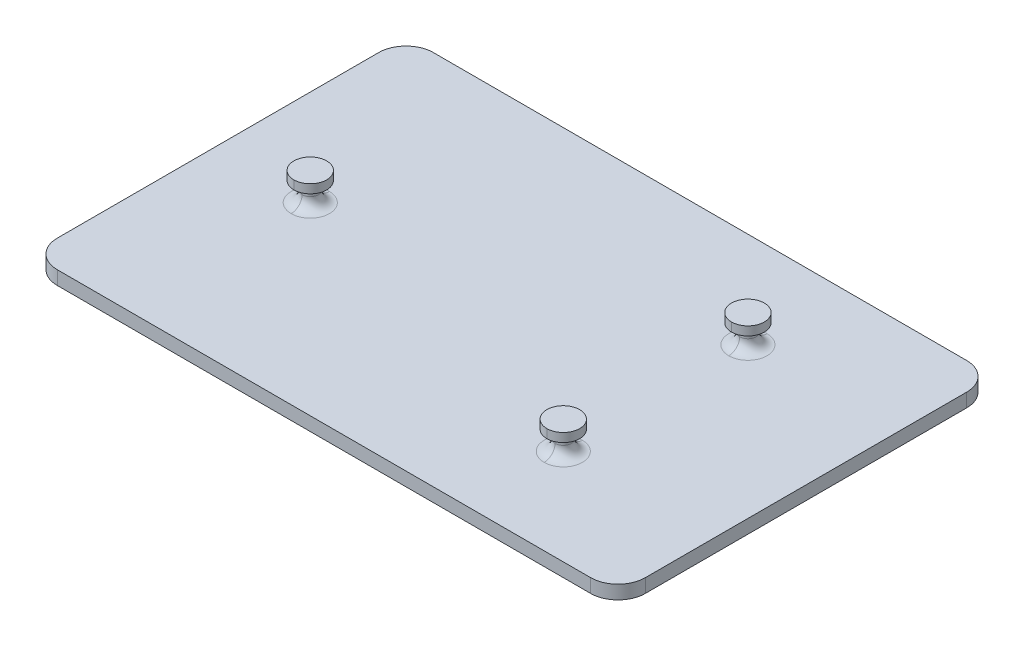
ISO-10303-21;
HEADER;
FILE_DESCRIPTION(('STEP AP214'),'2;1');
FILE_NAME('part.step','',(''),(''),'','','');
FILE_SCHEMA(('AUTOMOTIVE_DESIGN { 1 0 10303 214 1 1 1 1 }'));
ENDSEC;
DATA;
#1=APPLICATION_CONTEXT('core data for automotive mechanical design processes');
#2=APPLICATION_PROTOCOL_DEFINITION('international standard','automotive_design',2000,#1);
#3=PRODUCT_CONTEXT('',#1,'mechanical');
#4=PRODUCT('Part','Part','',(#3));
#5=PRODUCT_RELATED_PRODUCT_CATEGORY('part','',(#4));
#6=PRODUCT_DEFINITION_FORMATION('','',#4);
#7=PRODUCT_DEFINITION_CONTEXT('part definition',#1,'design');
#8=PRODUCT_DEFINITION('design','',#6,#7);
#9=PRODUCT_DEFINITION_SHAPE('','',#8);
#10=(LENGTH_UNIT() NAMED_UNIT(*) SI_UNIT(.MILLI.,.METRE.));
#11=(NAMED_UNIT(*) PLANE_ANGLE_UNIT() SI_UNIT($,.RADIAN.));
#12=(NAMED_UNIT(*) SI_UNIT($,.STERADIAN.) SOLID_ANGLE_UNIT());
#13=UNCERTAINTY_MEASURE_WITH_UNIT(LENGTH_MEASURE(1.E-05),#10,'distance_accuracy_value','');
#14=(GEOMETRIC_REPRESENTATION_CONTEXT(3) GLOBAL_UNCERTAINTY_ASSIGNED_CONTEXT((#13)) GLOBAL_UNIT_ASSIGNED_CONTEXT((#10,
#11,#12)) REPRESENTATION_CONTEXT('',''));
#15=CARTESIAN_POINT('',(0.,0.,0.));
#16=DIRECTION('',(0.,0.,1.));
#17=DIRECTION('',(1.,0.,0.));
#18=AXIS2_PLACEMENT_3D('',#15,#16,#17);
#19=CARTESIAN_POINT('',(-46.0375,5.715,0.79375));
#20=DIRECTION('',(0.,-1.,0.));
#21=DIRECTION('',(0.,0.,-1.));
#22=AXIS2_PLACEMENT_3D('',#19,#20,#21);
#23=TOROIDAL_SURFACE('',#22,4.445,2.54);
#24=CARTESIAN_POINT('',(-46.0375,5.715,5.23875));
#25=DIRECTION('',(1.,0.,0.));
#26=DIRECTION('',(0.,0.,-1.));
#27=AXIS2_PLACEMENT_3D('',#24,#25,#26);
#28=CIRCLE('',#27,2.54);
#29=CARTESIAN_POINT('',(-46.0375,3.175,5.23875));
#30=VERTEX_POINT('',#29);
#31=CARTESIAN_POINT('',(-46.0375,5.715,2.69875));
#32=VERTEX_POINT('',#31);
#33=EDGE_CURVE('E333',#30,#32,#28,.T.);
#34=ORIENTED_EDGE('',*,*,#33,.F.);
#35=CARTESIAN_POINT('',(-46.0375,3.175,0.79375));
#36=DIRECTION('',(0.,-1.,0.));
#37=DIRECTION('',(0.,0.,-1.));
#38=AXIS2_PLACEMENT_3D('',#35,#36,#37);
#39=CIRCLE('',#38,4.445);
#40=CARTESIAN_POINT('',(-46.0375,3.175,-3.65125));
#41=VERTEX_POINT('',#40);
#42=EDGE_CURVE('E348',#41,#30,#39,.T.);
#43=ORIENTED_EDGE('',*,*,#42,.F.);
#44=CARTESIAN_POINT('',(-46.0375,5.715,-3.65125));
#45=DIRECTION('',(-1.,0.,0.));
#46=DIRECTION('',(0.,0.,1.));
#47=AXIS2_PLACEMENT_3D('',#44,#45,#46);
#48=CIRCLE('',#47,2.54);
#49=CARTESIAN_POINT('',(-46.0375,5.715,-1.11125));
#50=VERTEX_POINT('',#49);
#51=EDGE_CURVE('E332',#41,#50,#48,.T.);
#52=ORIENTED_EDGE('',*,*,#51,.T.);
#53=CARTESIAN_POINT('',(-46.0375,5.715,0.79375));
#54=DIRECTION('',(0.,1.,0.));
#55=DIRECTION('',(0.,0.,-1.));
#56=AXIS2_PLACEMENT_3D('',#53,#54,#55);
#57=CIRCLE('',#56,1.905);
#58=EDGE_CURVE('E426',#32,#50,#57,.T.);
#59=ORIENTED_EDGE('',*,*,#58,.F.);
#60=EDGE_LOOP('',(#34,#43,#52,#59));
#61=FACE_BOUND('',#60,.T.);
#62=ADVANCED_FACE('F42',(#61),#23,.F.);
#63=CARTESIAN_POINT('',(33.3375,5.715,21.43125));
#64=DIRECTION('',(0.,-1.,0.));
#65=DIRECTION('',(0.,0.,-1.));
#66=AXIS2_PLACEMENT_3D('',#63,#64,#65);
#67=TOROIDAL_SURFACE('',#66,4.445,2.54);
#68=CARTESIAN_POINT('',(33.3375,5.715,25.87625));
#69=DIRECTION('',(1.,0.,0.));
#70=DIRECTION('',(0.,0.,-1.));
#71=AXIS2_PLACEMENT_3D('',#68,#69,#70);
#72=CIRCLE('',#71,2.54);
#73=CARTESIAN_POINT('',(33.3375,3.175,25.87625));
#74=VERTEX_POINT('',#73);
#75=CARTESIAN_POINT('',(33.3375,5.715,23.33625));
#76=VERTEX_POINT('',#75);
#77=EDGE_CURVE('E430',#74,#76,#72,.T.);
#78=ORIENTED_EDGE('',*,*,#77,.F.);
#79=CARTESIAN_POINT('',(33.3375,3.175,21.43125));
#80=DIRECTION('',(0.,-1.,0.));
#81=DIRECTION('',(0.,0.,-1.));
#82=AXIS2_PLACEMENT_3D('',#79,#80,#81);
#83=CIRCLE('',#82,4.445);
#84=CARTESIAN_POINT('',(33.3375,3.175,16.98625));
#85=VERTEX_POINT('',#84);
#86=EDGE_CURVE('E351',#85,#74,#83,.T.);
#87=ORIENTED_EDGE('',*,*,#86,.F.);
#88=CARTESIAN_POINT('',(33.3375,5.715,16.98625));
#89=DIRECTION('',(-1.,0.,0.));
#90=DIRECTION('',(0.,0.,1.));
#91=AXIS2_PLACEMENT_3D('',#88,#89,#90);
#92=CIRCLE('',#91,2.54);
#93=CARTESIAN_POINT('',(33.3375,5.715,19.52625));
#94=VERTEX_POINT('',#93);
#95=EDGE_CURVE('E342',#85,#94,#92,.T.);
#96=ORIENTED_EDGE('',*,*,#95,.T.);
#97=CARTESIAN_POINT('',(33.3375,5.715,21.43125));
#98=DIRECTION('',(0.,1.,0.));
#99=DIRECTION('',(0.,0.,-1.));
#100=AXIS2_PLACEMENT_3D('',#97,#98,#99);
#101=CIRCLE('',#100,1.905);
#102=EDGE_CURVE('E455',#76,#94,#101,.T.);
#103=ORIENTED_EDGE('',*,*,#102,.F.);
#104=EDGE_LOOP('',(#78,#87,#96,#103));
#105=FACE_BOUND('',#104,.T.);
#106=ADVANCED_FACE('F733',(#105),#67,.F.);
#107=CARTESIAN_POINT('',(33.3375,5.715,-21.43125));
#108=DIRECTION('',(0.,-1.,0.));
#109=DIRECTION('',(0.,0.,-1.));
#110=AXIS2_PLACEMENT_3D('',#107,#108,#109);
#111=TOROIDAL_SURFACE('',#110,4.445,2.54);
#112=CARTESIAN_POINT('',(33.3375,5.715,-16.98625));
#113=DIRECTION('',(1.,0.,0.));
#114=DIRECTION('',(0.,0.,-1.));
#115=AXIS2_PLACEMENT_3D('',#112,#113,#114);
#116=CIRCLE('',#115,2.54);
#117=CARTESIAN_POINT('',(33.3375,3.175,-16.98625));
#118=VERTEX_POINT('',#117);
#119=CARTESIAN_POINT('',(33.3375,5.715,-19.52625));
#120=VERTEX_POINT('',#119);
#121=EDGE_CURVE('E397',#118,#120,#116,.T.);
#122=ORIENTED_EDGE('',*,*,#121,.F.);
#123=CARTESIAN_POINT('',(33.3375,3.175,-21.43125));
#124=DIRECTION('',(0.,-1.,0.));
#125=DIRECTION('',(0.,0.,-1.));
#126=AXIS2_PLACEMENT_3D('',#123,#124,#125);
#127=CIRCLE('',#126,4.445);
#128=CARTESIAN_POINT('',(33.3375,3.175,-25.87625));
#129=VERTEX_POINT('',#128);
#130=EDGE_CURVE('E390',#129,#118,#127,.T.);
#131=ORIENTED_EDGE('',*,*,#130,.F.);
#132=CARTESIAN_POINT('',(33.3375,5.715,-25.87625));
#133=DIRECTION('',(-1.,0.,0.));
#134=DIRECTION('',(0.,0.,1.));
#135=AXIS2_PLACEMENT_3D('',#132,#133,#134);
#136=CIRCLE('',#135,2.54);
#137=CARTESIAN_POINT('',(33.3375,5.715,-23.33625));
#138=VERTEX_POINT('',#137);
#139=EDGE_CURVE('E400',#129,#138,#136,.T.);
#140=ORIENTED_EDGE('',*,*,#139,.T.);
#141=CARTESIAN_POINT('',(33.3375,5.715,-21.43125));
#142=DIRECTION('',(0.,1.,0.));
#143=DIRECTION('',(0.,0.,-1.));
#144=AXIS2_PLACEMENT_3D('',#141,#142,#143);
#145=CIRCLE('',#144,1.905);
#146=EDGE_CURVE('E306',#120,#138,#145,.T.);
#147=ORIENTED_EDGE('',*,*,#146,.F.);
#148=EDGE_LOOP('',(#122,#131,#140,#147));
#149=FACE_BOUND('',#148,.T.);
#150=ADVANCED_FACE('F739',(#149),#111,.F.);
#151=CARTESIAN_POINT('',(-61.9125,3.175,37.30625));
#152=DIRECTION('',(0.,-1.,0.));
#153=DIRECTION('',(0.,0.,-1.));
#154=AXIS2_PLACEMENT_3D('',#151,#152,#153);
#155=CYLINDRICAL_SURFACE('',#154,6.35);
#156=CARTESIAN_POINT('',(-61.9125,3.175,37.30625));
#157=DIRECTION('',(0.,1.,0.));
#158=DIRECTION('',(0.,0.,-1.));
#159=AXIS2_PLACEMENT_3D('',#156,#157,#158);
#160=CIRCLE('',#159,6.35);
#161=CARTESIAN_POINT('',(-68.2625,3.175,37.30625));
#162=VERTEX_POINT('',#161);
#163=CARTESIAN_POINT('',(-61.9125,3.175,43.65625));
#164=VERTEX_POINT('',#163);
#165=EDGE_CURVE('E365',#162,#164,#160,.T.);
#166=ORIENTED_EDGE('',*,*,#165,.F.);
#167=DIRECTION('',(0.,1.,0.));
#168=VECTOR('',#167,1.);
#169=CARTESIAN_POINT('',(-68.2625,3.175,37.30625));
#170=LINE('',#169,#168);
#171=CARTESIAN_POINT('',(-68.2625,0.,37.30625));
#172=VERTEX_POINT('',#171);
#173=EDGE_CURVE('E318',#172,#162,#170,.T.);
#174=ORIENTED_EDGE('',*,*,#173,.F.);
#175=CARTESIAN_POINT('',(-61.9125,0.,37.30625));
#176=DIRECTION('',(0.,-1.,0.));
#177=DIRECTION('',(0.,0.,-1.));
#178=AXIS2_PLACEMENT_3D('',#175,#176,#177);
#179=CIRCLE('',#178,6.35);
#180=CARTESIAN_POINT('',(-61.9125,0.,43.65625));
#181=VERTEX_POINT('',#180);
#182=EDGE_CURVE('E293',#181,#172,#179,.T.);
#183=ORIENTED_EDGE('',*,*,#182,.F.);
#184=DIRECTION('',(0.,-1.,0.));
#185=VECTOR('',#184,1.);
#186=CARTESIAN_POINT('',(-61.9125,3.175,43.65625));
#187=LINE('',#186,#185);
#188=EDGE_CURVE('E298',#164,#181,#187,.T.);
#189=ORIENTED_EDGE('',*,*,#188,.F.);
#190=EDGE_LOOP('',(#166,#174,#183,#189));
#191=FACE_BOUND('',#190,.T.);
#192=ADVANCED_FACE('F706',(#191),#155,.T.);
#193=CARTESIAN_POINT('',(-61.9125,3.175,-37.30625));
#194=DIRECTION('',(0.,-1.,0.));
#195=DIRECTION('',(0.,0.,-1.));
#196=AXIS2_PLACEMENT_3D('',#193,#194,#195);
#197=CYLINDRICAL_SURFACE('',#196,6.35);
#198=CARTESIAN_POINT('',(-61.9125,3.175,-37.30625));
#199=DIRECTION('',(0.,1.,0.));
#200=DIRECTION('',(0.,0.,-1.));
#201=AXIS2_PLACEMENT_3D('',#198,#199,#200);
#202=CIRCLE('',#201,6.35);
#203=CARTESIAN_POINT('',(-61.9125,3.175,-43.65625));
#204=VERTEX_POINT('',#203);
#205=CARTESIAN_POINT('',(-68.2625,3.175,-37.30625));
#206=VERTEX_POINT('',#205);
#207=EDGE_CURVE('E362',#204,#206,#202,.T.);
#208=ORIENTED_EDGE('',*,*,#207,.F.);
#209=DIRECTION('',(0.,1.,0.));
#210=VECTOR('',#209,1.);
#211=CARTESIAN_POINT('',(-61.9125,3.175,-43.65625));
#212=LINE('',#211,#210);
#213=CARTESIAN_POINT('',(-61.9125,0.,-43.65625));
#214=VERTEX_POINT('',#213);
#215=EDGE_CURVE('E327',#214,#204,#212,.T.);
#216=ORIENTED_EDGE('',*,*,#215,.F.);
#217=CARTESIAN_POINT('',(-61.9125,0.,-37.30625));
#218=DIRECTION('',(0.,-1.,0.));
#219=DIRECTION('',(0.,0.,-1.));
#220=AXIS2_PLACEMENT_3D('',#217,#218,#219);
#221=CIRCLE('',#220,6.35);
#222=CARTESIAN_POINT('',(-68.2625,0.,-37.30625));
#223=VERTEX_POINT('',#222);
#224=EDGE_CURVE('E290',#223,#214,#221,.T.);
#225=ORIENTED_EDGE('',*,*,#224,.F.);
#226=DIRECTION('',(0.,-1.,0.));
#227=VECTOR('',#226,1.);
#228=CARTESIAN_POINT('',(-68.2625,3.175,-37.30625));
#229=LINE('',#228,#227);
#230=EDGE_CURVE('E304',#206,#223,#229,.T.);
#231=ORIENTED_EDGE('',*,*,#230,.F.);
#232=EDGE_LOOP('',(#208,#216,#225,#231));
#233=FACE_BOUND('',#232,.T.);
#234=ADVANCED_FACE('F713',(#233),#197,.T.);
#235=CARTESIAN_POINT('',(61.9125,3.175,37.30625));
#236=DIRECTION('',(0.,-1.,0.));
#237=DIRECTION('',(0.,0.,-1.));
#238=AXIS2_PLACEMENT_3D('',#235,#236,#237);
#239=CYLINDRICAL_SURFACE('',#238,6.35);
#240=CARTESIAN_POINT('',(61.9125,3.175,37.30625));
#241=DIRECTION('',(0.,1.,0.));
#242=DIRECTION('',(0.,0.,-1.));
#243=AXIS2_PLACEMENT_3D('',#240,#241,#242);
#244=CIRCLE('',#243,6.35);
#245=CARTESIAN_POINT('',(61.9125,3.175,43.65625));
#246=VERTEX_POINT('',#245);
#247=CARTESIAN_POINT('',(68.2625,3.175,37.30625));
#248=VERTEX_POINT('',#247);
#249=EDGE_CURVE('E387',#246,#248,#244,.T.);
#250=ORIENTED_EDGE('',*,*,#249,.F.);
#251=DIRECTION('',(0.,1.,0.));
#252=VECTOR('',#251,1.);
#253=CARTESIAN_POINT('',(61.9125,3.175,43.65625));
#254=LINE('',#253,#252);
#255=CARTESIAN_POINT('',(61.9125,0.,43.65625));
#256=VERTEX_POINT('',#255);
#257=EDGE_CURVE('E299',#256,#246,#254,.T.);
#258=ORIENTED_EDGE('',*,*,#257,.F.);
#259=CARTESIAN_POINT('',(61.9125,0.,37.30625));
#260=DIRECTION('',(0.,-1.,0.));
#261=DIRECTION('',(0.,0.,-1.));
#262=AXIS2_PLACEMENT_3D('',#259,#260,#261);
#263=CIRCLE('',#262,6.35);
#264=CARTESIAN_POINT('',(68.2625,0.,37.30625));
#265=VERTEX_POINT('',#264);
#266=EDGE_CURVE('E356',#265,#256,#263,.T.);
#267=ORIENTED_EDGE('',*,*,#266,.F.);
#268=DIRECTION('',(0.,-1.,0.));
#269=VECTOR('',#268,1.);
#270=CARTESIAN_POINT('',(68.2625,3.175,37.30625));
#271=LINE('',#270,#269);
#272=EDGE_CURVE('E381',#248,#265,#271,.T.);
#273=ORIENTED_EDGE('',*,*,#272,.F.);
#274=EDGE_LOOP('',(#250,#258,#267,#273));
#275=FACE_BOUND('',#274,.T.);
#276=ADVANCED_FACE('F696',(#275),#239,.T.);
#277=CARTESIAN_POINT('',(61.9125,3.175,-37.30625));
#278=DIRECTION('',(0.,-1.,0.));
#279=DIRECTION('',(0.,0.,-1.));
#280=AXIS2_PLACEMENT_3D('',#277,#278,#279);
#281=CYLINDRICAL_SURFACE('',#280,6.35);
#282=CARTESIAN_POINT('',(61.9125,3.175,-37.30625));
#283=DIRECTION('',(0.,1.,0.));
#284=DIRECTION('',(0.,0.,-1.));
#285=AXIS2_PLACEMENT_3D('',#282,#283,#284);
#286=CIRCLE('',#285,6.35);
#287=CARTESIAN_POINT('',(68.2625,3.175,-37.30625));
#288=VERTEX_POINT('',#287);
#289=CARTESIAN_POINT('',(61.9125,3.175,-43.65625));
#290=VERTEX_POINT('',#289);
#291=EDGE_CURVE('E366',#288,#290,#286,.T.);
#292=ORIENTED_EDGE('',*,*,#291,.F.);
#293=DIRECTION('',(0.,1.,0.));
#294=VECTOR('',#293,1.);
#295=CARTESIAN_POINT('',(68.2625,3.175,-37.30625));
#296=LINE('',#295,#294);
#297=CARTESIAN_POINT('',(68.2625,0.,-37.30625));
#298=VERTEX_POINT('',#297);
#299=EDGE_CURVE('E382',#298,#288,#296,.T.);
#300=ORIENTED_EDGE('',*,*,#299,.F.);
#301=CARTESIAN_POINT('',(61.9125,0.,-37.30625));
#302=DIRECTION('',(0.,-1.,0.));
#303=DIRECTION('',(0.,0.,-1.));
#304=AXIS2_PLACEMENT_3D('',#301,#302,#303);
#305=CIRCLE('',#304,6.35);
#306=CARTESIAN_POINT('',(61.9125,0.,-43.65625));
#307=VERTEX_POINT('',#306);
#308=EDGE_CURVE('E289',#307,#298,#305,.T.);
#309=ORIENTED_EDGE('',*,*,#308,.F.);
#310=DIRECTION('',(0.,-1.,0.));
#311=VECTOR('',#310,1.);
#312=CARTESIAN_POINT('',(61.9125,3.175,-43.65625));
#313=LINE('',#312,#311);
#314=EDGE_CURVE('E312',#290,#307,#313,.T.);
#315=ORIENTED_EDGE('',*,*,#314,.F.);
#316=EDGE_LOOP('',(#292,#300,#309,#315));
#317=FACE_BOUND('',#316,.T.);
#318=ADVANCED_FACE('F690',(#317),#281,.T.);
#319=CARTESIAN_POINT('',(33.3375,7.62,21.43125));
#320=DIRECTION('',(0.,1.,0.));
#321=DIRECTION('',(1.,0.,0.));
#322=AXIS2_PLACEMENT_3D('',#319,#320,#321);
#323=PLANE('',#322);
#324=CARTESIAN_POINT('',(33.3375,7.62,21.43125));
#325=DIRECTION('',(0.,1.,0.));
#326=DIRECTION('',(0.,0.,1.));
#327=AXIS2_PLACEMENT_3D('',#324,#325,#326);
#328=CIRCLE('',#327,2.405);
#329=CARTESIAN_POINT('',(33.3375,7.62,23.83625));
#330=VERTEX_POINT('',#329);
#331=CARTESIAN_POINT('',(33.3375,7.62,19.02625));
#332=VERTEX_POINT('',#331);
#333=EDGE_CURVE('E520',#330,#332,#328,.T.);
#334=ORIENTED_EDGE('',*,*,#333,.T.);
#335=CARTESIAN_POINT('',(33.3375,7.62,21.43125));
#336=DIRECTION('',(0.,1.,0.));
#337=DIRECTION('',(0.,0.,1.));
#338=AXIS2_PLACEMENT_3D('',#335,#336,#337);
#339=CIRCLE('',#338,2.405);
#340=EDGE_CURVE('E523',#332,#330,#339,.T.);
#341=ORIENTED_EDGE('',*,*,#340,.T.);
#342=EDGE_LOOP('',(#334,#341));
#343=FACE_BOUND('',#342,.T.);
#344=CARTESIAN_POINT('',(33.3375,7.62,21.43125));
#345=DIRECTION('',(0.,1.,0.));
#346=DIRECTION('',(0.,0.,1.));
#347=AXIS2_PLACEMENT_3D('',#344,#345,#346);
#348=CIRCLE('',#347,3.81);
#349=CARTESIAN_POINT('',(33.3375,7.62,17.62125));
#350=VERTEX_POINT('',#349);
#351=CARTESIAN_POINT('',(33.3375,7.62,25.24125));
#352=VERTEX_POINT('',#351);
#353=EDGE_CURVE('E338',#350,#352,#348,.T.);
#354=ORIENTED_EDGE('',*,*,#353,.F.);
#355=CARTESIAN_POINT('',(33.3375,7.62,21.43125));
#356=DIRECTION('',(0.,1.,0.));
#357=DIRECTION('',(0.,0.,1.));
#358=AXIS2_PLACEMENT_3D('',#355,#356,#357);
#359=CIRCLE('',#358,3.81);
#360=EDGE_CURVE('E376',#352,#350,#359,.T.);
#361=ORIENTED_EDGE('',*,*,#360,.F.);
#362=EDGE_LOOP('',(#354,#361));
#363=FACE_BOUND('',#362,.T.);
#364=ADVANCED_FACE('F779',(#343,#363),#323,.F.);
#365=CARTESIAN_POINT('',(33.3375,9.652,21.43125));
#366=DIRECTION('',(0.,1.,0.));
#367=DIRECTION('',(1.,0.,0.));
#368=AXIS2_PLACEMENT_3D('',#365,#366,#367);
#369=PLANE('',#368);
#370=CARTESIAN_POINT('',(33.3375,9.652,21.43125));
#371=DIRECTION('',(0.,1.,0.));
#372=DIRECTION('',(0.,0.,1.));
#373=AXIS2_PLACEMENT_3D('',#370,#371,#372);
#374=CIRCLE('',#373,3.81);
#375=CARTESIAN_POINT('',(33.3375,9.652,17.62125));
#376=VERTEX_POINT('',#375);
#377=CARTESIAN_POINT('',(33.3375,9.652,25.24125));
#378=VERTEX_POINT('',#377);
#379=EDGE_CURVE('E337',#376,#378,#374,.T.);
#380=ORIENTED_EDGE('',*,*,#379,.T.);
#381=CARTESIAN_POINT('',(33.3375,9.652,21.43125));
#382=DIRECTION('',(0.,1.,0.));
#383=DIRECTION('',(0.,0.,1.));
#384=AXIS2_PLACEMENT_3D('',#381,#382,#383);
#385=CIRCLE('',#384,3.81);
#386=EDGE_CURVE('E404',#378,#376,#385,.T.);
#387=ORIENTED_EDGE('',*,*,#386,.T.);
#388=EDGE_LOOP('',(#380,#387));
#389=FACE_BOUND('',#388,.T.);
#390=ADVANCED_FACE('F782',(#389),#369,.T.);
#391=CARTESIAN_POINT('',(33.3375,9.652,21.43125));
#392=DIRECTION('',(0.,-1.,0.));
#393=DIRECTION('',(0.,0.,-1.));
#394=AXIS2_PLACEMENT_3D('',#391,#392,#393);
#395=CYLINDRICAL_SURFACE('',#394,3.81);
#396=DIRECTION('',(0.,-1.,0.));
#397=VECTOR('',#396,1.);
#398=CARTESIAN_POINT('',(33.3375,9.652,25.24125));
#399=LINE('',#398,#397);
#400=EDGE_CURVE('E419',#378,#352,#399,.T.);
#401=ORIENTED_EDGE('',*,*,#400,.F.);
#402=ORIENTED_EDGE('',*,*,#379,.F.);
#403=DIRECTION('',(0.,-1.,0.));
#404=VECTOR('',#403,1.);
#405=CARTESIAN_POINT('',(33.3375,9.652,17.62125));
#406=LINE('',#405,#404);
#407=EDGE_CURVE('E371',#376,#350,#406,.T.);
#408=ORIENTED_EDGE('',*,*,#407,.T.);
#409=ORIENTED_EDGE('',*,*,#353,.T.);
#410=EDGE_LOOP('',(#401,#402,#408,#409));
#411=FACE_BOUND('',#410,.T.);
#412=ADVANCED_FACE('F835',(#411),#395,.T.);
#413=CARTESIAN_POINT('',(33.3375,7.62,-21.43125));
#414=DIRECTION('',(0.,1.,0.));
#415=DIRECTION('',(1.,0.,0.));
#416=AXIS2_PLACEMENT_3D('',#413,#414,#415);
#417=PLANE('',#416);
#418=CARTESIAN_POINT('',(33.3375,7.62,-21.43125));
#419=DIRECTION('',(0.,1.,0.));
#420=DIRECTION('',(0.,0.,1.));
#421=AXIS2_PLACEMENT_3D('',#418,#419,#420);
#422=CIRCLE('',#421,2.405);
#423=CARTESIAN_POINT('',(33.3375,7.62,-19.02625));
#424=VERTEX_POINT('',#423);
#425=CARTESIAN_POINT('',(33.3375,7.62,-23.83625));
#426=VERTEX_POINT('',#425);
#427=EDGE_CURVE('E341',#424,#426,#422,.T.);
#428=ORIENTED_EDGE('',*,*,#427,.T.);
#429=CARTESIAN_POINT('',(33.3375,7.62,-21.43125));
#430=DIRECTION('',(0.,1.,0.));
#431=DIRECTION('',(0.,0.,1.));
#432=AXIS2_PLACEMENT_3D('',#429,#430,#431);
#433=CIRCLE('',#432,2.405);
#434=EDGE_CURVE('E512',#426,#424,#433,.T.);
#435=ORIENTED_EDGE('',*,*,#434,.T.);
#436=EDGE_LOOP('',(#428,#435));
#437=FACE_BOUND('',#436,.T.);
#438=CARTESIAN_POINT('',(33.3375,7.62,-21.43125));
#439=DIRECTION('',(0.,1.,0.));
#440=DIRECTION('',(0.,0.,1.));
#441=AXIS2_PLACEMENT_3D('',#438,#439,#440);
#442=CIRCLE('',#441,3.81);
#443=CARTESIAN_POINT('',(33.3375,7.62,-25.24125));
#444=VERTEX_POINT('',#443);
#445=CARTESIAN_POINT('',(33.3375,7.62,-17.62125));
#446=VERTEX_POINT('',#445);
#447=EDGE_CURVE('E334',#444,#446,#442,.T.);
#448=ORIENTED_EDGE('',*,*,#447,.F.);
#449=CARTESIAN_POINT('',(33.3375,7.62,-21.43125));
#450=DIRECTION('',(0.,1.,0.));
#451=DIRECTION('',(0.,0.,1.));
#452=AXIS2_PLACEMENT_3D('',#449,#450,#451);
#453=CIRCLE('',#452,3.81);
#454=EDGE_CURVE('E361',#446,#444,#453,.T.);
#455=ORIENTED_EDGE('',*,*,#454,.F.);
#456=EDGE_LOOP('',(#448,#455));
#457=FACE_BOUND('',#456,.T.);
#458=ADVANCED_FACE('F838',(#437,#457),#417,.F.);
#459=CARTESIAN_POINT('',(33.3375,9.652,-21.43125));
#460=DIRECTION('',(0.,1.,0.));
#461=DIRECTION('',(1.,0.,0.));
#462=AXIS2_PLACEMENT_3D('',#459,#460,#461);
#463=PLANE('',#462);
#464=CARTESIAN_POINT('',(33.3375,9.652,-21.43125));
#465=DIRECTION('',(0.,1.,0.));
#466=DIRECTION('',(0.,0.,1.));
#467=AXIS2_PLACEMENT_3D('',#464,#465,#466);
#468=CIRCLE('',#467,3.81);
#469=CARTESIAN_POINT('',(33.3375,9.652,-25.24125));
#470=VERTEX_POINT('',#469);
#471=CARTESIAN_POINT('',(33.3375,9.652,-17.62125));
#472=VERTEX_POINT('',#471);
#473=EDGE_CURVE('E267',#470,#472,#468,.T.);
#474=ORIENTED_EDGE('',*,*,#473,.T.);
#475=CARTESIAN_POINT('',(33.3375,9.652,-21.43125));
#476=DIRECTION('',(0.,1.,0.));
#477=DIRECTION('',(0.,0.,1.));
#478=AXIS2_PLACEMENT_3D('',#475,#476,#477);
#479=CIRCLE('',#478,3.81);
#480=EDGE_CURVE('E375',#472,#470,#479,.T.);
#481=ORIENTED_EDGE('',*,*,#480,.T.);
#482=EDGE_LOOP('',(#474,#481));
#483=FACE_BOUND('',#482,.T.);
#484=ADVANCED_FACE('F795',(#483),#463,.T.);
#485=CARTESIAN_POINT('',(33.3375,9.652,-21.43125));
#486=DIRECTION('',(0.,-1.,0.));
#487=DIRECTION('',(0.,0.,-1.));
#488=AXIS2_PLACEMENT_3D('',#485,#486,#487);
#489=CYLINDRICAL_SURFACE('',#488,3.81);
#490=DIRECTION('',(0.,-1.,0.));
#491=VECTOR('',#490,1.);
#492=CARTESIAN_POINT('',(33.3375,9.652,-17.62125));
#493=LINE('',#492,#491);
#494=EDGE_CURVE('E383',#472,#446,#493,.T.);
#495=ORIENTED_EDGE('',*,*,#494,.F.);
#496=ORIENTED_EDGE('',*,*,#473,.F.);
#497=DIRECTION('',(0.,-1.,0.));
#498=VECTOR('',#497,1.);
#499=CARTESIAN_POINT('',(33.3375,9.652,-25.24125));
#500=LINE('',#499,#498);
#501=EDGE_CURVE('E357',#470,#444,#500,.T.);
#502=ORIENTED_EDGE('',*,*,#501,.T.);
#503=ORIENTED_EDGE('',*,*,#447,.T.);
#504=EDGE_LOOP('',(#495,#496,#502,#503));
#505=FACE_BOUND('',#504,.T.);
#506=ADVANCED_FACE('F792',(#505),#489,.T.);
#507=CARTESIAN_POINT('',(-46.0375,7.62,0.79375));
#508=DIRECTION('',(0.,1.,0.));
#509=DIRECTION('',(1.,0.,0.));
#510=AXIS2_PLACEMENT_3D('',#507,#508,#509);
#511=PLANE('',#510);
#512=CARTESIAN_POINT('',(-46.0375,7.62,0.79375));
#513=DIRECTION('',(0.,1.,0.));
#514=DIRECTION('',(0.,0.,1.));
#515=AXIS2_PLACEMENT_3D('',#512,#513,#514);
#516=CIRCLE('',#515,2.405);
#517=CARTESIAN_POINT('',(-46.0375,7.62,3.19875));
#518=VERTEX_POINT('',#517);
#519=CARTESIAN_POINT('',(-46.0375,7.62,-1.61125));
#520=VERTEX_POINT('',#519);
#521=EDGE_CURVE('E537',#518,#520,#516,.T.);
#522=ORIENTED_EDGE('',*,*,#521,.T.);
#523=CARTESIAN_POINT('',(-46.0375,7.62,0.79375));
#524=DIRECTION('',(0.,1.,0.));
#525=DIRECTION('',(0.,0.,1.));
#526=AXIS2_PLACEMENT_3D('',#523,#524,#525);
#527=CIRCLE('',#526,2.405);
#528=EDGE_CURVE('E540',#520,#518,#527,.T.);
#529=ORIENTED_EDGE('',*,*,#528,.T.);
#530=EDGE_LOOP('',(#522,#529));
#531=FACE_BOUND('',#530,.T.);
#532=CARTESIAN_POINT('',(-46.0375,7.62,0.79375));
#533=DIRECTION('',(0.,1.,0.));
#534=DIRECTION('',(0.,0.,1.));
#535=AXIS2_PLACEMENT_3D('',#532,#533,#534);
#536=CIRCLE('',#535,3.81);
#537=CARTESIAN_POINT('',(-46.0375,7.62,-3.01625));
#538=VERTEX_POINT('',#537);
#539=CARTESIAN_POINT('',(-46.0375,7.62,4.60375));
#540=VERTEX_POINT('',#539);
#541=EDGE_CURVE('E258',#538,#540,#536,.T.);
#542=ORIENTED_EDGE('',*,*,#541,.F.);
#543=CARTESIAN_POINT('',(-46.0375,7.62,0.79375));
#544=DIRECTION('',(0.,1.,0.));
#545=DIRECTION('',(0.,0.,1.));
#546=AXIS2_PLACEMENT_3D('',#543,#544,#545);
#547=CIRCLE('',#546,3.81);
#548=EDGE_CURVE('E262',#540,#538,#547,.T.);
#549=ORIENTED_EDGE('',*,*,#548,.F.);
#550=EDGE_LOOP('',(#542,#549));
#551=FACE_BOUND('',#550,.T.);
#552=ADVANCED_FACE('F260',(#531,#551),#511,.F.);
#553=CARTESIAN_POINT('',(-46.0375,9.652,0.79375));
#554=DIRECTION('',(0.,1.,0.));
#555=DIRECTION('',(1.,0.,0.));
#556=AXIS2_PLACEMENT_3D('',#553,#554,#555);
#557=PLANE('',#556);
#558=CARTESIAN_POINT('',(-46.0375,9.652,0.79375));
#559=DIRECTION('',(0.,1.,0.));
#560=DIRECTION('',(0.,0.,1.));
#561=AXIS2_PLACEMENT_3D('',#558,#559,#560);
#562=CIRCLE('',#561,3.81);
#563=CARTESIAN_POINT('',(-46.0375,9.652,-3.01625));
#564=VERTEX_POINT('',#563);
#565=CARTESIAN_POINT('',(-46.0375,9.652,4.60375));
#566=VERTEX_POINT('',#565);
#567=EDGE_CURVE('E268',#564,#566,#562,.T.);
#568=ORIENTED_EDGE('',*,*,#567,.T.);
#569=CARTESIAN_POINT('',(-46.0375,9.652,0.79375));
#570=DIRECTION('',(0.,1.,0.));
#571=DIRECTION('',(0.,0.,1.));
#572=AXIS2_PLACEMENT_3D('',#569,#570,#571);
#573=CIRCLE('',#572,3.81);
#574=EDGE_CURVE('E285',#566,#564,#573,.T.);
#575=ORIENTED_EDGE('',*,*,#574,.T.);
#576=EDGE_LOOP('',(#568,#575));
#577=FACE_BOUND('',#576,.T.);
#578=ADVANCED_FACE('F826',(#577),#557,.T.);
#579=CARTESIAN_POINT('',(-46.0375,9.652,0.79375));
#580=DIRECTION('',(0.,-1.,0.));
#581=DIRECTION('',(0.,0.,-1.));
#582=AXIS2_PLACEMENT_3D('',#579,#580,#581);
#583=CYLINDRICAL_SURFACE('',#582,3.81);
#584=DIRECTION('',(0.,-1.,0.));
#585=VECTOR('',#584,1.);
#586=CARTESIAN_POINT('',(-46.0375,9.652,4.60375));
#587=LINE('',#586,#585);
#588=EDGE_CURVE('E280',#566,#540,#587,.T.);
#589=ORIENTED_EDGE('',*,*,#588,.F.);
#590=ORIENTED_EDGE('',*,*,#567,.F.);
#591=DIRECTION('',(0.,-1.,0.));
#592=VECTOR('',#591,1.);
#593=CARTESIAN_POINT('',(-46.0375,9.652,-3.01625));
#594=LINE('',#593,#592);
#595=EDGE_CURVE('E271',#564,#538,#594,.T.);
#596=ORIENTED_EDGE('',*,*,#595,.T.);
#597=ORIENTED_EDGE('',*,*,#541,.T.);
#598=EDGE_LOOP('',(#589,#590,#596,#597));
#599=FACE_BOUND('',#598,.T.);
#600=ADVANCED_FACE('F272',(#599),#583,.T.);
#601=CARTESIAN_POINT('',(33.3375,7.62,21.43125));
#602=DIRECTION('',(0.,-1.,0.));
#603=DIRECTION('',(0.,0.,-1.));
#604=AXIS2_PLACEMENT_3D('',#601,#602,#603);
#605=CYLINDRICAL_SURFACE('',#604,1.905);
#606=DIRECTION('',(0.,-1.,0.));
#607=VECTOR('',#606,1.);
#608=CARTESIAN_POINT('',(33.3375,7.62,23.33625));
#609=LINE('',#608,#607);
#610=CARTESIAN_POINT('',(33.3375,7.12,23.33625));
#611=VERTEX_POINT('',#610);
#612=EDGE_CURVE('E277',#611,#76,#609,.T.);
#613=ORIENTED_EDGE('',*,*,#612,.F.);
#614=CARTESIAN_POINT('',(33.3375,7.12,21.43125));
#615=DIRECTION('',(0.,1.,0.));
#616=DIRECTION('',(0.,0.,1.));
#617=AXIS2_PLACEMENT_3D('',#614,#615,#616);
#618=CIRCLE('',#617,1.905);
#619=CARTESIAN_POINT('',(33.3375,7.12,19.52625));
#620=VERTEX_POINT('',#619);
#621=EDGE_CURVE('E527',#611,#620,#618,.F.);
#622=ORIENTED_EDGE('',*,*,#621,.T.);
#623=DIRECTION('',(0.,-1.,0.));
#624=VECTOR('',#623,1.);
#625=CARTESIAN_POINT('',(33.3375,7.62,19.52625));
#626=LINE('',#625,#624);
#627=EDGE_CURVE('E439',#620,#94,#626,.T.);
#628=ORIENTED_EDGE('',*,*,#627,.T.);
#629=CARTESIAN_POINT('',(33.3375,5.715,21.43125));
#630=DIRECTION('',(0.,1.,0.));
#631=DIRECTION('',(0.,0.,-1.));
#632=AXIS2_PLACEMENT_3D('',#629,#630,#631);
#633=CIRCLE('',#632,1.905);
#634=EDGE_CURVE('E347',#94,#76,#633,.T.);
#635=ORIENTED_EDGE('',*,*,#634,.T.);
#636=EDGE_LOOP('',(#613,#622,#628,#635));
#637=FACE_BOUND('',#636,.T.);
#638=ADVANCED_FACE('F761',(#637),#605,.T.);
#639=CARTESIAN_POINT('',(33.3375,7.62,-21.43125));
#640=DIRECTION('',(0.,-1.,0.));
#641=DIRECTION('',(0.,0.,-1.));
#642=AXIS2_PLACEMENT_3D('',#639,#640,#641);
#643=CYLINDRICAL_SURFACE('',#642,1.905);
#644=DIRECTION('',(0.,-1.,0.));
#645=VECTOR('',#644,1.);
#646=CARTESIAN_POINT('',(33.3375,7.62,-19.52625));
#647=LINE('',#646,#645);
#648=CARTESIAN_POINT('',(33.3375,7.12,-19.52625));
#649=VERTEX_POINT('',#648);
#650=EDGE_CURVE('E311',#649,#120,#647,.T.);
#651=ORIENTED_EDGE('',*,*,#650,.F.);
#652=CARTESIAN_POINT('',(33.3375,7.12,-21.43125));
#653=DIRECTION('',(0.,1.,0.));
#654=DIRECTION('',(0.,0.,1.));
#655=AXIS2_PLACEMENT_3D('',#652,#653,#654);
#656=CIRCLE('',#655,1.905);
#657=CARTESIAN_POINT('',(33.3375,7.12,-23.33625));
#658=VERTEX_POINT('',#657);
#659=EDGE_CURVE('E516',#649,#658,#656,.F.);
#660=ORIENTED_EDGE('',*,*,#659,.T.);
#661=DIRECTION('',(0.,-1.,0.));
#662=VECTOR('',#661,1.);
#663=CARTESIAN_POINT('',(33.3375,7.62,-23.33625));
#664=LINE('',#663,#662);
#665=EDGE_CURVE('E310',#658,#138,#664,.T.);
#666=ORIENTED_EDGE('',*,*,#665,.T.);
#667=CARTESIAN_POINT('',(33.3375,5.715,-21.43125));
#668=DIRECTION('',(0.,1.,0.));
#669=DIRECTION('',(0.,0.,-1.));
#670=AXIS2_PLACEMENT_3D('',#667,#668,#669);
#671=CIRCLE('',#670,1.905);
#672=EDGE_CURVE('E405',#138,#120,#671,.T.);
#673=ORIENTED_EDGE('',*,*,#672,.T.);
#674=EDGE_LOOP('',(#651,#660,#666,#673));
#675=FACE_BOUND('',#674,.T.);
#676=ADVANCED_FACE('F763',(#675),#643,.T.);
#677=CARTESIAN_POINT('',(-46.0375,7.62,0.79375));
#678=DIRECTION('',(0.,-1.,0.));
#679=DIRECTION('',(0.,0.,-1.));
#680=AXIS2_PLACEMENT_3D('',#677,#678,#679);
#681=CYLINDRICAL_SURFACE('',#680,1.905);
#682=DIRECTION('',(0.,-1.,0.));
#683=VECTOR('',#682,1.);
#684=CARTESIAN_POINT('',(-46.0375,7.62,2.69875));
#685=LINE('',#684,#683);
#686=CARTESIAN_POINT('',(-46.0375,7.12,2.69875));
#687=VERTEX_POINT('',#686);
#688=EDGE_CURVE('E412',#687,#32,#685,.T.);
#689=ORIENTED_EDGE('',*,*,#688,.F.);
#690=CARTESIAN_POINT('',(-46.0375,7.12,0.79375));
#691=DIRECTION('',(0.,1.,0.));
#692=DIRECTION('',(0.,0.,1.));
#693=AXIS2_PLACEMENT_3D('',#690,#691,#692);
#694=CIRCLE('',#693,1.905);
#695=CARTESIAN_POINT('',(-46.0375,7.12,-1.11125));
#696=VERTEX_POINT('',#695);
#697=EDGE_CURVE('E52',#687,#696,#694,.F.);
#698=ORIENTED_EDGE('',*,*,#697,.T.);
#699=DIRECTION('',(0.,-1.,0.));
#700=VECTOR('',#699,1.);
#701=CARTESIAN_POINT('',(-46.0375,7.62,-1.11125));
#702=LINE('',#701,#700);
#703=EDGE_CURVE('E305',#696,#50,#702,.T.);
#704=ORIENTED_EDGE('',*,*,#703,.T.);
#705=CARTESIAN_POINT('',(-46.0375,5.715,0.79375));
#706=DIRECTION('',(0.,1.,0.));
#707=DIRECTION('',(0.,0.,-1.));
#708=AXIS2_PLACEMENT_3D('',#705,#706,#707);
#709=CIRCLE('',#708,1.905);
#710=EDGE_CURVE('E328',#50,#32,#709,.T.);
#711=ORIENTED_EDGE('',*,*,#710,.T.);
#712=EDGE_LOOP('',(#689,#698,#704,#711));
#713=FACE_BOUND('',#712,.T.);
#714=ADVANCED_FACE('F727',(#713),#681,.T.);
#715=CARTESIAN_POINT('',(0.,0.,0.));
#716=DIRECTION('',(0.,-1.,0.));
#717=DIRECTION('',(0.,0.,-1.));
#718=AXIS2_PLACEMENT_3D('',#715,#716,#717);
#719=PLANE('',#718);
#720=DIRECTION('',(-1.,0.,0.));
#721=VECTOR('',#720,1.);
#722=CARTESIAN_POINT('',(68.2625,0.,-43.65625));
#723=LINE('',#722,#721);
#724=EDGE_CURVE('E316',#307,#214,#723,.T.);
#725=ORIENTED_EDGE('',*,*,#724,.F.);
#726=ORIENTED_EDGE('',*,*,#308,.T.);
#727=DIRECTION('',(0.,0.,-1.));
#728=VECTOR('',#727,1.);
#729=CARTESIAN_POINT('',(68.2625,0.,-43.65625));
#730=LINE('',#729,#728);
#731=EDGE_CURVE('E420',#265,#298,#730,.T.);
#732=ORIENTED_EDGE('',*,*,#731,.F.);
#733=ORIENTED_EDGE('',*,*,#266,.T.);
#734=DIRECTION('',(1.,0.,0.));
#735=VECTOR('',#734,1.);
#736=CARTESIAN_POINT('',(68.2625,0.,43.65625));
#737=LINE('',#736,#735);
#738=EDGE_CURVE('E322',#181,#256,#737,.T.);
#739=ORIENTED_EDGE('',*,*,#738,.F.);
#740=ORIENTED_EDGE('',*,*,#182,.T.);
#741=DIRECTION('',(0.,0.,1.));
#742=VECTOR('',#741,1.);
#743=CARTESIAN_POINT('',(-68.2625,0.,-43.65625));
#744=LINE('',#743,#742);
#745=EDGE_CURVE('E323',#223,#172,#744,.T.);
#746=ORIENTED_EDGE('',*,*,#745,.F.);
#747=ORIENTED_EDGE('',*,*,#224,.T.);
#748=EDGE_LOOP('',(#725,#726,#732,#733,#739,#740,#746,#747));
#749=FACE_BOUND('',#748,.T.);
#750=ADVANCED_FACE('F687',(#749),#719,.T.);
#751=CARTESIAN_POINT('',(0.,3.175,0.));
#752=DIRECTION('',(0.,-1.,0.));
#753=DIRECTION('',(0.,0.,-1.));
#754=AXIS2_PLACEMENT_3D('',#751,#752,#753);
#755=PLANE('',#754);
#756=ORIENTED_EDGE('',*,*,#42,.T.);
#757=CARTESIAN_POINT('',(-46.0375,3.175,0.79375));
#758=DIRECTION('',(0.,-1.,0.));
#759=DIRECTION('',(0.,0.,-1.));
#760=AXIS2_PLACEMENT_3D('',#757,#758,#759);
#761=CIRCLE('',#760,4.445);
#762=EDGE_CURVE('E452',#30,#41,#761,.T.);
#763=ORIENTED_EDGE('',*,*,#762,.T.);
#764=EDGE_LOOP('',(#756,#763));
#765=FACE_BOUND('',#764,.T.);
#766=ORIENTED_EDGE('',*,*,#86,.T.);
#767=CARTESIAN_POINT('',(33.3375,3.175,21.43125));
#768=DIRECTION('',(0.,-1.,0.));
#769=DIRECTION('',(0.,0.,-1.));
#770=AXIS2_PLACEMENT_3D('',#767,#768,#769);
#771=CIRCLE('',#770,4.445);
#772=EDGE_CURVE('E370',#74,#85,#771,.T.);
#773=ORIENTED_EDGE('',*,*,#772,.T.);
#774=EDGE_LOOP('',(#766,#773));
#775=FACE_BOUND('',#774,.T.);
#776=ORIENTED_EDGE('',*,*,#130,.T.);
#777=CARTESIAN_POINT('',(33.3375,3.175,-21.43125));
#778=DIRECTION('',(0.,-1.,0.));
#779=DIRECTION('',(0.,0.,-1.));
#780=AXIS2_PLACEMENT_3D('',#777,#778,#779);
#781=CIRCLE('',#780,4.445);
#782=EDGE_CURVE('E346',#118,#129,#781,.T.);
#783=ORIENTED_EDGE('',*,*,#782,.T.);
#784=EDGE_LOOP('',(#776,#783));
#785=FACE_BOUND('',#784,.T.);
#786=DIRECTION('',(0.,0.,-1.));
#787=VECTOR('',#786,1.);
#788=CARTESIAN_POINT('',(68.2625,3.175,-43.65625));
#789=LINE('',#788,#787);
#790=EDGE_CURVE('E377',#248,#288,#789,.T.);
#791=ORIENTED_EDGE('',*,*,#790,.T.);
#792=ORIENTED_EDGE('',*,*,#291,.T.);
#793=DIRECTION('',(-1.,0.,0.));
#794=VECTOR('',#793,1.);
#795=CARTESIAN_POINT('',(68.2625,3.175,-43.65625));
#796=LINE('',#795,#794);
#797=EDGE_CURVE('E317',#290,#204,#796,.T.);
#798=ORIENTED_EDGE('',*,*,#797,.T.);
#799=ORIENTED_EDGE('',*,*,#207,.T.);
#800=DIRECTION('',(0.,0.,1.));
#801=VECTOR('',#800,1.);
#802=CARTESIAN_POINT('',(-68.2625,3.175,-43.65625));
#803=LINE('',#802,#801);
#804=EDGE_CURVE('E300',#206,#162,#803,.T.);
#805=ORIENTED_EDGE('',*,*,#804,.T.);
#806=ORIENTED_EDGE('',*,*,#165,.T.);
#807=DIRECTION('',(1.,0.,0.));
#808=VECTOR('',#807,1.);
#809=CARTESIAN_POINT('',(68.2625,3.175,43.65625));
#810=LINE('',#809,#808);
#811=EDGE_CURVE('E294',#164,#246,#810,.T.);
#812=ORIENTED_EDGE('',*,*,#811,.T.);
#813=ORIENTED_EDGE('',*,*,#249,.T.);
#814=EDGE_LOOP('',(#791,#792,#798,#799,#805,#806,#812,#813));
#815=FACE_BOUND('',#814,.T.);
#816=ADVANCED_FACE('F718',(#765,#775,#785,#815),#755,.F.);
#817=CARTESIAN_POINT('',(68.2625,3.175,-43.65625));
#818=DIRECTION('',(0.,0.,1.));
#819=DIRECTION('',(1.,0.,0.));
#820=AXIS2_PLACEMENT_3D('',#817,#818,#819);
#821=PLANE('',#820);
#822=ORIENTED_EDGE('',*,*,#797,.F.);
#823=ORIENTED_EDGE('',*,*,#314,.T.);
#824=ORIENTED_EDGE('',*,*,#724,.T.);
#825=ORIENTED_EDGE('',*,*,#215,.T.);
#826=EDGE_LOOP('',(#822,#823,#824,#825));
#827=FACE_BOUND('',#826,.T.);
#828=ADVANCED_FACE('F716',(#827),#821,.F.);
#829=CARTESIAN_POINT('',(68.2625,3.175,-43.65625));
#830=DIRECTION('',(-1.,0.,0.));
#831=DIRECTION('',(0.,1.,0.));
#832=AXIS2_PLACEMENT_3D('',#829,#830,#831);
#833=PLANE('',#832);
#834=ORIENTED_EDGE('',*,*,#731,.T.);
#835=ORIENTED_EDGE('',*,*,#299,.T.);
#836=ORIENTED_EDGE('',*,*,#790,.F.);
#837=ORIENTED_EDGE('',*,*,#272,.T.);
#838=EDGE_LOOP('',(#834,#835,#836,#837));
#839=FACE_BOUND('',#838,.T.);
#840=ADVANCED_FACE('F693',(#839),#833,.F.);
#841=CARTESIAN_POINT('',(68.2625,3.175,43.65625));
#842=DIRECTION('',(0.,0.,-1.));
#843=DIRECTION('',(-1.,0.,0.));
#844=AXIS2_PLACEMENT_3D('',#841,#842,#843);
#845=PLANE('',#844);
#846=ORIENTED_EDGE('',*,*,#738,.T.);
#847=ORIENTED_EDGE('',*,*,#257,.T.);
#848=ORIENTED_EDGE('',*,*,#811,.F.);
#849=ORIENTED_EDGE('',*,*,#188,.T.);
#850=EDGE_LOOP('',(#846,#847,#848,#849));
#851=FACE_BOUND('',#850,.T.);
#852=ADVANCED_FACE('F702',(#851),#845,.F.);
#853=CARTESIAN_POINT('',(-68.2625,3.175,-43.65625));
#854=DIRECTION('',(1.,0.,0.));
#855=DIRECTION('',(0.,0.,-1.));
#856=AXIS2_PLACEMENT_3D('',#853,#854,#855);
#857=PLANE('',#856);
#858=ORIENTED_EDGE('',*,*,#804,.F.);
#859=ORIENTED_EDGE('',*,*,#230,.T.);
#860=ORIENTED_EDGE('',*,*,#745,.T.);
#861=ORIENTED_EDGE('',*,*,#173,.T.);
#862=EDGE_LOOP('',(#858,#859,#860,#861));
#863=FACE_BOUND('',#862,.T.);
#864=ADVANCED_FACE('F709',(#863),#857,.F.);
#865=CARTESIAN_POINT('',(-46.0375,7.62,0.79375));
#866=DIRECTION('',(0.,-1.,0.));
#867=DIRECTION('',(0.,0.,-1.));
#868=AXIS2_PLACEMENT_3D('',#865,#866,#867);
#869=CYLINDRICAL_SURFACE('',#868,1.905);
#870=ORIENTED_EDGE('',*,*,#703,.F.);
#871=CARTESIAN_POINT('',(-46.0375,7.12,0.79375));
#872=DIRECTION('',(0.,1.,0.));
#873=DIRECTION('',(0.,0.,1.));
#874=AXIS2_PLACEMENT_3D('',#871,#872,#873);
#875=CIRCLE('',#874,1.905);
#876=EDGE_CURVE('E11',#696,#687,#875,.F.);
#877=ORIENTED_EDGE('',*,*,#876,.T.);
#878=ORIENTED_EDGE('',*,*,#688,.T.);
#879=ORIENTED_EDGE('',*,*,#58,.T.);
#880=EDGE_LOOP('',(#870,#877,#878,#879));
#881=FACE_BOUND('',#880,.T.);
#882=ADVANCED_FACE('F745',(#881),#869,.T.);
#883=CARTESIAN_POINT('',(33.3375,7.62,-21.43125));
#884=DIRECTION('',(0.,-1.,0.));
#885=DIRECTION('',(0.,0.,-1.));
#886=AXIS2_PLACEMENT_3D('',#883,#884,#885);
#887=CYLINDRICAL_SURFACE('',#886,1.905);
#888=ORIENTED_EDGE('',*,*,#665,.F.);
#889=CARTESIAN_POINT('',(33.3375,7.12,-21.43125));
#890=DIRECTION('',(0.,1.,0.));
#891=DIRECTION('',(0.,0.,1.));
#892=AXIS2_PLACEMENT_3D('',#889,#890,#891);
#893=CIRCLE('',#892,1.905);
#894=EDGE_CURVE('E531',#658,#649,#893,.F.);
#895=ORIENTED_EDGE('',*,*,#894,.T.);
#896=ORIENTED_EDGE('',*,*,#650,.T.);
#897=ORIENTED_EDGE('',*,*,#146,.T.);
#898=EDGE_LOOP('',(#888,#895,#896,#897));
#899=FACE_BOUND('',#898,.T.);
#900=ADVANCED_FACE('F757',(#899),#887,.T.);
#901=CARTESIAN_POINT('',(33.3375,7.62,21.43125));
#902=DIRECTION('',(0.,-1.,0.));
#903=DIRECTION('',(0.,0.,-1.));
#904=AXIS2_PLACEMENT_3D('',#901,#902,#903);
#905=CYLINDRICAL_SURFACE('',#904,1.905);
#906=ORIENTED_EDGE('',*,*,#627,.F.);
#907=CARTESIAN_POINT('',(33.3375,7.12,21.43125));
#908=DIRECTION('',(0.,1.,0.));
#909=DIRECTION('',(0.,0.,1.));
#910=AXIS2_PLACEMENT_3D('',#907,#908,#909);
#911=CIRCLE('',#910,1.905);
#912=EDGE_CURVE('E534',#620,#611,#911,.F.);
#913=ORIENTED_EDGE('',*,*,#912,.T.);
#914=ORIENTED_EDGE('',*,*,#612,.T.);
#915=ORIENTED_EDGE('',*,*,#102,.T.);
#916=EDGE_LOOP('',(#906,#913,#914,#915));
#917=FACE_BOUND('',#916,.T.);
#918=ADVANCED_FACE('F749',(#917),#905,.T.);
#919=CARTESIAN_POINT('',(-46.0375,9.652,0.79375));
#920=DIRECTION('',(0.,-1.,0.));
#921=DIRECTION('',(0.,0.,-1.));
#922=AXIS2_PLACEMENT_3D('',#919,#920,#921);
#923=CYLINDRICAL_SURFACE('',#922,3.81);
#924=ORIENTED_EDGE('',*,*,#574,.F.);
#925=ORIENTED_EDGE('',*,*,#588,.T.);
#926=ORIENTED_EDGE('',*,*,#548,.T.);
#927=ORIENTED_EDGE('',*,*,#595,.F.);
#928=EDGE_LOOP('',(#924,#925,#926,#927));
#929=FACE_BOUND('',#928,.T.);
#930=ADVANCED_FACE('F279',(#929),#923,.T.);
#931=CARTESIAN_POINT('',(33.3375,9.652,-21.43125));
#932=DIRECTION('',(0.,-1.,0.));
#933=DIRECTION('',(0.,0.,-1.));
#934=AXIS2_PLACEMENT_3D('',#931,#932,#933);
#935=CYLINDRICAL_SURFACE('',#934,3.81);
#936=ORIENTED_EDGE('',*,*,#480,.F.);
#937=ORIENTED_EDGE('',*,*,#494,.T.);
#938=ORIENTED_EDGE('',*,*,#454,.T.);
#939=ORIENTED_EDGE('',*,*,#501,.F.);
#940=EDGE_LOOP('',(#936,#937,#938,#939));
#941=FACE_BOUND('',#940,.T.);
#942=ADVANCED_FACE('F748',(#941),#935,.T.);
#943=CARTESIAN_POINT('',(33.3375,9.652,21.43125));
#944=DIRECTION('',(0.,-1.,0.));
#945=DIRECTION('',(0.,0.,-1.));
#946=AXIS2_PLACEMENT_3D('',#943,#944,#945);
#947=CYLINDRICAL_SURFACE('',#946,3.81);
#948=ORIENTED_EDGE('',*,*,#386,.F.);
#949=ORIENTED_EDGE('',*,*,#400,.T.);
#950=ORIENTED_EDGE('',*,*,#360,.T.);
#951=ORIENTED_EDGE('',*,*,#407,.F.);
#952=EDGE_LOOP('',(#948,#949,#950,#951));
#953=FACE_BOUND('',#952,.T.);
#954=ADVANCED_FACE('F750',(#953),#947,.T.);
#955=CARTESIAN_POINT('',(33.3375,5.715,-21.43125));
#956=DIRECTION('',(0.,-1.,0.));
#957=DIRECTION('',(0.,0.,-1.));
#958=AXIS2_PLACEMENT_3D('',#955,#956,#957);
#959=TOROIDAL_SURFACE('',#958,4.445,2.54);
#960=ORIENTED_EDGE('',*,*,#782,.F.);
#961=ORIENTED_EDGE('',*,*,#121,.T.);
#962=ORIENTED_EDGE('',*,*,#672,.F.);
#963=ORIENTED_EDGE('',*,*,#139,.F.);
#964=EDGE_LOOP('',(#960,#961,#962,#963));
#965=FACE_BOUND('',#964,.T.);
#966=ADVANCED_FACE('F753',(#965),#959,.F.);
#967=CARTESIAN_POINT('',(33.3375,5.715,21.43125));
#968=DIRECTION('',(0.,-1.,0.));
#969=DIRECTION('',(0.,0.,-1.));
#970=AXIS2_PLACEMENT_3D('',#967,#968,#969);
#971=TOROIDAL_SURFACE('',#970,4.445,2.54);
#972=ORIENTED_EDGE('',*,*,#772,.F.);
#973=ORIENTED_EDGE('',*,*,#77,.T.);
#974=ORIENTED_EDGE('',*,*,#634,.F.);
#975=ORIENTED_EDGE('',*,*,#95,.F.);
#976=EDGE_LOOP('',(#972,#973,#974,#975));
#977=FACE_BOUND('',#976,.T.);
#978=ADVANCED_FACE('F847',(#977),#971,.F.);
#979=CARTESIAN_POINT('',(-46.0375,5.715,0.79375));
#980=DIRECTION('',(0.,-1.,0.));
#981=DIRECTION('',(0.,0.,-1.));
#982=AXIS2_PLACEMENT_3D('',#979,#980,#981);
#983=TOROIDAL_SURFACE('',#982,4.445,2.54);
#984=ORIENTED_EDGE('',*,*,#762,.F.);
#985=ORIENTED_EDGE('',*,*,#33,.T.);
#986=ORIENTED_EDGE('',*,*,#710,.F.);
#987=ORIENTED_EDGE('',*,*,#51,.F.);
#988=EDGE_LOOP('',(#984,#985,#986,#987));
#989=FACE_BOUND('',#988,.T.);
#990=ADVANCED_FACE('F808',(#989),#983,.F.);
#991=CARTESIAN_POINT('',(33.3375,7.12,-21.43125));
#992=DIRECTION('',(0.,1.,0.));
#993=DIRECTION('',(0.,0.,1.));
#994=AXIS2_PLACEMENT_3D('',#991,#992,#993);
#995=TOROIDAL_SURFACE('',#994,2.405,0.5);
#996=CARTESIAN_POINT('',(33.3375,7.12,-19.02625));
#997=DIRECTION('',(1.,0.,0.));
#998=DIRECTION('',(0.,0.,-1.));
#999=AXIS2_PLACEMENT_3D('',#996,#997,#998);
#1000=CIRCLE('',#999,0.5);
#1001=EDGE_CURVE('E547',#649,#424,#1000,.T.);
#1002=ORIENTED_EDGE('',*,*,#1001,.F.);
#1003=ORIENTED_EDGE('',*,*,#894,.F.);
#1004=CARTESIAN_POINT('',(33.3375,7.12,-23.83625));
#1005=DIRECTION('',(1.,0.,0.));
#1006=DIRECTION('',(0.,0.,-1.));
#1007=AXIS2_PLACEMENT_3D('',#1004,#1005,#1006);
#1008=CIRCLE('',#1007,0.5);
#1009=EDGE_CURVE('E509',#426,#658,#1008,.T.);
#1010=ORIENTED_EDGE('',*,*,#1009,.F.);
#1011=ORIENTED_EDGE('',*,*,#427,.F.);
#1012=EDGE_LOOP('',(#1002,#1003,#1010,#1011));
#1013=FACE_BOUND('',#1012,.T.);
#1014=ADVANCED_FACE('F804',(#1013),#995,.F.);
#1015=CARTESIAN_POINT('',(33.3375,7.12,-21.43125));
#1016=DIRECTION('',(0.,1.,0.));
#1017=DIRECTION('',(0.,0.,1.));
#1018=AXIS2_PLACEMENT_3D('',#1015,#1016,#1017);
#1019=TOROIDAL_SURFACE('',#1018,2.405,0.5);
#1020=ORIENTED_EDGE('',*,*,#1009,.T.);
#1021=ORIENTED_EDGE('',*,*,#659,.F.);
#1022=ORIENTED_EDGE('',*,*,#1001,.T.);
#1023=ORIENTED_EDGE('',*,*,#434,.F.);
#1024=EDGE_LOOP('',(#1020,#1021,#1022,#1023));
#1025=FACE_BOUND('',#1024,.T.);
#1026=ADVANCED_FACE('F800',(#1025),#1019,.F.);
#1027=CARTESIAN_POINT('',(33.3375,7.12,21.43125));
#1028=DIRECTION('',(0.,1.,0.));
#1029=DIRECTION('',(0.,0.,1.));
#1030=AXIS2_PLACEMENT_3D('',#1027,#1028,#1029);
#1031=TOROIDAL_SURFACE('',#1030,2.405,0.5);
#1032=CARTESIAN_POINT('',(33.3375,7.12,23.83625));
#1033=DIRECTION('',(1.,0.,0.));
#1034=DIRECTION('',(0.,0.,-1.));
#1035=AXIS2_PLACEMENT_3D('',#1032,#1033,#1034);
#1036=CIRCLE('',#1035,0.5);
#1037=EDGE_CURVE('E553',#611,#330,#1036,.T.);
#1038=ORIENTED_EDGE('',*,*,#1037,.F.);
#1039=ORIENTED_EDGE('',*,*,#912,.F.);
#1040=CARTESIAN_POINT('',(33.3375,7.12,19.02625));
#1041=DIRECTION('',(1.,0.,0.));
#1042=DIRECTION('',(0.,0.,-1.));
#1043=AXIS2_PLACEMENT_3D('',#1040,#1041,#1042);
#1044=CIRCLE('',#1043,0.5);
#1045=EDGE_CURVE('E550',#332,#620,#1044,.T.);
#1046=ORIENTED_EDGE('',*,*,#1045,.F.);
#1047=ORIENTED_EDGE('',*,*,#333,.F.);
#1048=EDGE_LOOP('',(#1038,#1039,#1046,#1047));
#1049=FACE_BOUND('',#1048,.T.);
#1050=ADVANCED_FACE('F803',(#1049),#1031,.F.);
#1051=CARTESIAN_POINT('',(33.3375,7.12,21.43125));
#1052=DIRECTION('',(0.,1.,0.));
#1053=DIRECTION('',(0.,0.,1.));
#1054=AXIS2_PLACEMENT_3D('',#1051,#1052,#1053);
#1055=TOROIDAL_SURFACE('',#1054,2.405,0.5);
#1056=ORIENTED_EDGE('',*,*,#1045,.T.);
#1057=ORIENTED_EDGE('',*,*,#621,.F.);
#1058=ORIENTED_EDGE('',*,*,#1037,.T.);
#1059=ORIENTED_EDGE('',*,*,#340,.F.);
#1060=EDGE_LOOP('',(#1056,#1057,#1058,#1059));
#1061=FACE_BOUND('',#1060,.T.);
#1062=ADVANCED_FACE('F810',(#1061),#1055,.F.);
#1063=CARTESIAN_POINT('',(-46.0375,7.12,0.79375));
#1064=DIRECTION('',(0.,1.,0.));
#1065=DIRECTION('',(0.,0.,1.));
#1066=AXIS2_PLACEMENT_3D('',#1063,#1064,#1065);
#1067=TOROIDAL_SURFACE('',#1066,2.405,0.5);
#1068=CARTESIAN_POINT('',(-46.0375,7.12,3.19875));
#1069=DIRECTION('',(1.,0.,0.));
#1070=DIRECTION('',(0.,0.,-1.));
#1071=AXIS2_PLACEMENT_3D('',#1068,#1069,#1070);
#1072=CIRCLE('',#1071,0.5);
#1073=EDGE_CURVE('E557',#687,#518,#1072,.T.);
#1074=ORIENTED_EDGE('',*,*,#1073,.F.);
#1075=ORIENTED_EDGE('',*,*,#876,.F.);
#1076=CARTESIAN_POINT('',(-46.0375,7.12,-1.61125));
#1077=DIRECTION('',(1.,0.,0.));
#1078=DIRECTION('',(0.,0.,-1.));
#1079=AXIS2_PLACEMENT_3D('',#1076,#1077,#1078);
#1080=CIRCLE('',#1079,0.5);
#1081=EDGE_CURVE('E46',#520,#696,#1080,.T.);
#1082=ORIENTED_EDGE('',*,*,#1081,.F.);
#1083=ORIENTED_EDGE('',*,*,#521,.F.);
#1084=EDGE_LOOP('',(#1074,#1075,#1082,#1083));
#1085=FACE_BOUND('',#1084,.T.);
#1086=ADVANCED_FACE('F44',(#1085),#1067,.F.);
#1087=CARTESIAN_POINT('',(-46.0375,7.12,0.79375));
#1088=DIRECTION('',(0.,1.,0.));
#1089=DIRECTION('',(0.,0.,1.));
#1090=AXIS2_PLACEMENT_3D('',#1087,#1088,#1089);
#1091=TOROIDAL_SURFACE('',#1090,2.405,0.5);
#1092=ORIENTED_EDGE('',*,*,#1081,.T.);
#1093=ORIENTED_EDGE('',*,*,#697,.F.);
#1094=ORIENTED_EDGE('',*,*,#1073,.T.);
#1095=ORIENTED_EDGE('',*,*,#528,.F.);
#1096=EDGE_LOOP('',(#1092,#1093,#1094,#1095));
#1097=FACE_BOUND('',#1096,.T.);
#1098=ADVANCED_FACE('F816',(#1097),#1091,.F.);
#1099=CLOSED_SHELL('',(#62,#106,#150,#192,#234,#276,#318,#364,#390,#412,#458,#484,#506,#552,
#578,#600,#638,#676,#714,#750,#816,#828,#840,#852,#864,#882,#900,#918,#930,#942,#954,#966,#978,
#990,#1014,#1026,#1050,#1062,#1086,#1098));
#1100=MANIFOLD_SOLID_BREP('B2',#1099);
#1101=ADVANCED_BREP_SHAPE_REPRESENTATION('',(#18,#1100),#14);
#1102=SHAPE_DEFINITION_REPRESENTATION(#9,#1101);
ENDSEC;
END-ISO-10303-21;
